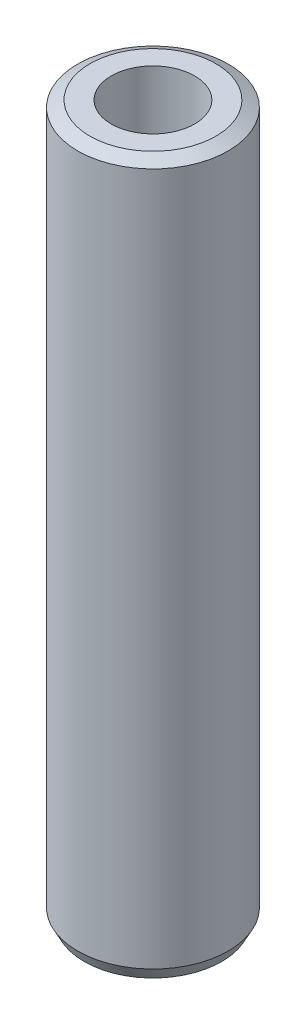
ISO-10303-21;
HEADER;
FILE_DESCRIPTION(('STEP AP214'),'2;1');
FILE_NAME('part.step','',(''),(''),'','','');
FILE_SCHEMA(('AUTOMOTIVE_DESIGN { 1 0 10303 214 1 1 1 1 }'));
ENDSEC;
DATA;
#1=APPLICATION_CONTEXT('core data for automotive mechanical design processes');
#2=APPLICATION_PROTOCOL_DEFINITION('international standard','automotive_design',2000,#1);
#3=PRODUCT_CONTEXT('',#1,'mechanical');
#4=PRODUCT('Part','Part','',(#3));
#5=PRODUCT_RELATED_PRODUCT_CATEGORY('part','',(#4));
#6=PRODUCT_DEFINITION_FORMATION('','',#4);
#7=PRODUCT_DEFINITION_CONTEXT('part definition',#1,'design');
#8=PRODUCT_DEFINITION('design','',#6,#7);
#9=PRODUCT_DEFINITION_SHAPE('','',#8);
#10=(LENGTH_UNIT() NAMED_UNIT(*) SI_UNIT(.MILLI.,.METRE.));
#11=(NAMED_UNIT(*) PLANE_ANGLE_UNIT() SI_UNIT($,.RADIAN.));
#12=(NAMED_UNIT(*) SI_UNIT($,.STERADIAN.) SOLID_ANGLE_UNIT());
#13=UNCERTAINTY_MEASURE_WITH_UNIT(LENGTH_MEASURE(1.E-05),#10,'distance_accuracy_value','');
#14=(GEOMETRIC_REPRESENTATION_CONTEXT(3) GLOBAL_UNCERTAINTY_ASSIGNED_CONTEXT((#13)) GLOBAL_UNIT_ASSIGNED_CONTEXT((#10,
#11,#12)) REPRESENTATION_CONTEXT('',''));
#15=CARTESIAN_POINT('',(0.,0.,0.));
#16=DIRECTION('',(0.,0.,1.));
#17=DIRECTION('',(1.,0.,0.));
#18=AXIS2_PLACEMENT_3D('',#15,#16,#17);
#19=CARTESIAN_POINT('',(0.,543.585864411854,0.));
#20=DIRECTION('',(0.,-1.,0.));
#21=DIRECTION('',(0.,0.,-1.));
#22=AXIS2_PLACEMENT_3D('',#19,#20,#21);
#23=CYLINDRICAL_SURFACE('',#22,57.5);
#24=CARTESIAN_POINT('',(0.,538.599060666265,0.));
#25=DIRECTION('',(0.,1.,0.));
#26=DIRECTION('',(0.,0.,1.));
#27=AXIS2_PLACEMENT_3D('',#24,#25,#26);
#28=CIRCLE('',#27,57.5);
#29=CARTESIAN_POINT('',(0.,538.599060666265,57.5));
#30=VERTEX_POINT('',#29);
#31=EDGE_CURVE('E50',#30,#30,#28,.F.);
#32=ORIENTED_EDGE('',*,*,#31,.T.);
#33=EDGE_LOOP('',(#32));
#34=FACE_BOUND('',#33,.T.);
#35=CARTESIAN_POINT('',(0.,9.46466921031897,0.));
#36=DIRECTION('',(0.,1.,0.));
#37=DIRECTION('',(0.,0.,1.));
#38=AXIS2_PLACEMENT_3D('',#35,#36,#37);
#39=CIRCLE('',#38,57.5);
#40=CARTESIAN_POINT('',(0.,9.46466921031897,57.5));
#41=VERTEX_POINT('',#40);
#42=EDGE_CURVE('E51',#41,#41,#39,.T.);
#43=ORIENTED_EDGE('',*,*,#42,.T.);
#44=EDGE_LOOP('',(#43));
#45=FACE_BOUND('',#44,.T.);
#46=ADVANCED_FACE('F39',(#34,#45),#23,.T.);
#47=CARTESIAN_POINT('',(0.,543.585864411854,0.));
#48=DIRECTION('',(0.,1.,0.));
#49=DIRECTION('',(0.,0.,1.));
#50=AXIS2_PLACEMENT_3D('',#47,#48,#49);
#51=PLANE('',#50);
#52=CARTESIAN_POINT('',(0.,543.585864411854,0.));
#53=DIRECTION('',(0.,1.,0.));
#54=DIRECTION('',(0.,0.,1.));
#55=AXIS2_PLACEMENT_3D('',#52,#53,#54);
#56=CIRCLE('',#55,48.0353307896811);
#57=CARTESIAN_POINT('',(0.,543.585864411854,48.0353307896811));
#58=VERTEX_POINT('',#57);
#59=EDGE_CURVE('E54',#58,#58,#56,.T.);
#60=ORIENTED_EDGE('',*,*,#59,.T.);
#61=EDGE_LOOP('',(#60));
#62=FACE_BOUND('',#61,.T.);
#63=CARTESIAN_POINT('',(0.,543.585864411854,0.));
#64=DIRECTION('',(0.,1.,0.));
#65=DIRECTION('',(0.,0.,1.));
#66=AXIS2_PLACEMENT_3D('',#63,#64,#65);
#67=CIRCLE('',#66,31.8417238432678);
#68=CARTESIAN_POINT('',(0.,543.585864411854,31.8417238432678));
#69=VERTEX_POINT('',#68);
#70=EDGE_CURVE('E58',#69,#69,#67,.T.);
#71=ORIENTED_EDGE('',*,*,#70,.F.);
#72=EDGE_LOOP('',(#71));
#73=FACE_BOUND('',#72,.T.);
#74=ADVANCED_FACE('F69',(#62,#73),#51,.T.);
#75=CARTESIAN_POINT('',(0.,0.,0.));
#76=DIRECTION('',(0.,1.,0.));
#77=DIRECTION('',(0.,0.,1.));
#78=AXIS2_PLACEMENT_3D('',#75,#76,#77);
#79=PLANE('',#78);
#80=CARTESIAN_POINT('',(0.,0.,0.));
#81=DIRECTION('',(0.,1.,0.));
#82=DIRECTION('',(0.,0.,1.));
#83=AXIS2_PLACEMENT_3D('',#80,#81,#82);
#84=CIRCLE('',#83,52.5131962544113);
#85=CARTESIAN_POINT('',(0.,0.,52.5131962544113));
#86=VERTEX_POINT('',#85);
#87=EDGE_CURVE('E10',#86,#86,#84,.F.);
#88=ORIENTED_EDGE('',*,*,#87,.T.);
#89=EDGE_LOOP('',(#88));
#90=FACE_BOUND('',#89,.T.);
#91=CARTESIAN_POINT('',(0.,0.,0.));
#92=DIRECTION('',(0.,1.,0.));
#93=DIRECTION('',(0.,0.,1.));
#94=AXIS2_PLACEMENT_3D('',#91,#92,#93);
#95=CIRCLE('',#94,31.8417238432678);
#96=CARTESIAN_POINT('',(0.,0.,31.8417238432678));
#97=VERTEX_POINT('',#96);
#98=EDGE_CURVE('E63',#97,#97,#95,.T.);
#99=ORIENTED_EDGE('',*,*,#98,.T.);
#100=EDGE_LOOP('',(#99));
#101=FACE_BOUND('',#100,.T.);
#102=ADVANCED_FACE('F75',(#90,#101),#79,.F.);
#103=CARTESIAN_POINT('',(0.,543.585864411854,0.));
#104=DIRECTION('',(0.,-1.,0.));
#105=DIRECTION('',(0.,0.,-1.));
#106=AXIS2_PLACEMENT_3D('',#103,#104,#105);
#107=CYLINDRICAL_SURFACE('',#106,31.8417238432678);
#108=ORIENTED_EDGE('',*,*,#70,.T.);
#109=EDGE_LOOP('',(#108));
#110=FACE_BOUND('',#109,.T.);
#111=ORIENTED_EDGE('',*,*,#98,.F.);
#112=EDGE_LOOP('',(#111));
#113=FACE_BOUND('',#112,.T.);
#114=ADVANCED_FACE('F70',(#110,#113),#107,.F.);
#115=CARTESIAN_POINT('',(0.,543.585864411854,0.));
#116=DIRECTION('',(0.,-1.,0.));
#117=DIRECTION('',(0.,0.,-1.));
#118=AXIS2_PLACEMENT_3D('',#115,#116,#117);
#119=CONICAL_SURFACE('',#118,48.0353307896811,1.08587181305399);
#120=ORIENTED_EDGE('',*,*,#31,.F.);
#121=EDGE_LOOP('',(#120));
#122=FACE_BOUND('',#121,.T.);
#123=ORIENTED_EDGE('',*,*,#59,.F.);
#124=EDGE_LOOP('',(#123));
#125=FACE_BOUND('',#124,.T.);
#126=ADVANCED_FACE('F81',(#122,#125),#119,.T.);
#127=CARTESIAN_POINT('',(0.,9.46466921031897,0.));
#128=DIRECTION('',(0.,1.,0.));
#129=DIRECTION('',(0.,0.,1.));
#130=AXIS2_PLACEMENT_3D('',#127,#128,#129);
#131=CONICAL_SURFACE('',#130,57.5,0.484924513740904);
#132=CARTESIAN_POINT('',(0.,0.,52.5131962544113));
#133=CARTESIAN_POINT('',(0.,0.0985903042741541,52.5651421267612));
#134=CARTESIAN_POINT('',(0.,0.19718060854831,52.6170879991111));
#135=CARTESIAN_POINT('',(0.,0.394361217096622,52.7209797438108));
#136=CARTESIAN_POINT('',(0.,0.492951521370778,52.7729256161607));
#137=CARTESIAN_POINT('',(0.,0.69013212991909,52.8768173608605));
#138=CARTESIAN_POINT('',(0.,0.788722434193245,52.9287632332104));
#139=CARTESIAN_POINT('',(0.,0.985903042741557,53.0326549779101));
#140=CARTESIAN_POINT('',(0.,1.08449334701571,53.08460085026));
#141=CARTESIAN_POINT('',(0.,1.28167395556402,53.1884925949598));
#142=CARTESIAN_POINT('',(0.,1.38026425983818,53.2404384673097));
#143=CARTESIAN_POINT('',(0.,1.57744486838649,53.3443302120094));
#144=CARTESIAN_POINT('',(0.,1.67603517266065,53.3962760843593));
#145=CARTESIAN_POINT('',(0.,1.87321578120896,53.5001678290591));
#146=CARTESIAN_POINT('',(0.,1.97180608548312,53.5521137014089));
#147=CARTESIAN_POINT('',(0.,2.16898669403143,53.6560054461087));
#148=CARTESIAN_POINT('',(0.,2.26757699830558,53.7079513184586));
#149=CARTESIAN_POINT('',(0.,2.4647576068539,53.8118430631584));
#150=CARTESIAN_POINT('',(0.,2.56334791112805,53.8637889355082));
#151=CARTESIAN_POINT('',(0.,2.76052851967636,53.967680680208));
#152=CARTESIAN_POINT('',(0.,2.85911882395052,54.0196265525579));
#153=CARTESIAN_POINT('',(0.,3.05629943249883,54.1235182972577));
#154=CARTESIAN_POINT('',(0.,3.15488973677299,54.1754641696075));
#155=CARTESIAN_POINT('',(0.,3.3520703453213,54.2793559143073));
#156=CARTESIAN_POINT('',(0.,3.45066064959546,54.3313017866572));
#157=CARTESIAN_POINT('',(0.,3.64784125814377,54.435193531357));
#158=CARTESIAN_POINT('',(0.,3.74643156241792,54.4871394037068));
#159=CARTESIAN_POINT('',(0.,3.94361217096624,54.5910311484066));
#160=CARTESIAN_POINT('',(0.,4.04220247524039,54.6429770207565));
#161=CARTESIAN_POINT('',(0.,4.2393830837887,54.7468687654562));
#162=CARTESIAN_POINT('',(0.,4.33797338806286,54.7988146378061));
#163=CARTESIAN_POINT('',(0.,4.53515399661117,54.9027063825059));
#164=CARTESIAN_POINT('',(0.,4.63374430088533,54.9546522548558));
#165=CARTESIAN_POINT('',(0.,4.83092490943364,55.0585439995555));
#166=CARTESIAN_POINT('',(0.,4.92951521370779,55.1104898719054));
#167=CARTESIAN_POINT('',(0.,5.12669582225611,55.2143816166052));
#168=CARTESIAN_POINT('',(0.,5.22528612653026,55.2663274889551));
#169=CARTESIAN_POINT('',(0.,5.42246673507857,55.3702192336548));
#170=CARTESIAN_POINT('',(0.,5.52105703935273,55.4221651060047));
#171=CARTESIAN_POINT('',(0.,5.71823764790104,55.5260568507045));
#172=CARTESIAN_POINT('',(0.,5.8168279521752,55.5780027230544));
#173=CARTESIAN_POINT('',(0.,6.01400856072351,55.6818944677541));
#174=CARTESIAN_POINT('',(0.,6.11259886499766,55.733840340104));
#175=CARTESIAN_POINT('',(0.,6.30977947354598,55.8377320848038));
#176=CARTESIAN_POINT('',(0.,6.40836977782013,55.8896779571537));
#177=CARTESIAN_POINT('',(0.,6.60555038636844,55.9935697018534));
#178=CARTESIAN_POINT('',(0.,6.7041406906426,56.0455155742033));
#179=CARTESIAN_POINT('',(0.,6.90132129919091,56.1494073189031));
#180=CARTESIAN_POINT('',(0.,6.99991160346507,56.2013531912529));
#181=CARTESIAN_POINT('',(0.,7.19709221201338,56.3052449359527));
#182=CARTESIAN_POINT('',(0.,7.29568251628754,56.3571908083026));
#183=CARTESIAN_POINT('',(0.,7.49286312483585,56.4610825530024));
#184=CARTESIAN_POINT('',(0.,7.59145342911,56.5130284253522));
#185=CARTESIAN_POINT('',(0.,7.78863403765831,56.616920170052));
#186=CARTESIAN_POINT('',(0.,7.88722434193247,56.6688660424019));
#187=CARTESIAN_POINT('',(0.,8.08440495048078,56.7727577871017));
#188=CARTESIAN_POINT('',(0.,8.18299525475494,56.8247036594515));
#189=CARTESIAN_POINT('',(0.,8.38017586330325,56.9285954041513));
#190=CARTESIAN_POINT('',(0.,8.47876616757741,56.9805412765012));
#191=CARTESIAN_POINT('',(0.,8.67594677612572,57.084433021201));
#192=CARTESIAN_POINT('',(0.,8.77453708039988,57.1363788935508));
#193=CARTESIAN_POINT('',(0.,8.97171768894819,57.2402706382506));
#194=CARTESIAN_POINT('',(0.,9.07030799322234,57.2922165106005));
#195=CARTESIAN_POINT('',(0.,9.26748860177065,57.3961082553002));
#196=CARTESIAN_POINT('',(0.,9.36607890604481,57.4480541276501));
#197=CARTESIAN_POINT('',(0.,9.46466921031897,57.5));
#198=B_SPLINE_CURVE_WITH_KNOTS('',3,(#132,#133,#134,#135,#136,#137,#138,#139,#140,#141,#142,
#143,#144,#145,#146,#147,#148,#149,#150,#151,#152,#153,#154,#155,#156,#157,#158,#159,#160,#161,
#162,#163,#164,#165,#166,#167,#168,#169,#170,#171,#172,#173,#174,#175,#176,#177,#178,#179,#180,
#181,#182,#183,#184,#185,#186,#187,#188,#189,#190,#191,#192,#193,#194,#195,#196,#197),
.UNSPECIFIED.,.F.,.F.,(4,2,2,2,2,2,2,2,2,2,2,2,2,2,2,2,2,2,2,2,2,2,2,2,2,2,2,2,2,2,2,2,4),(0.,
0.334313917986595,0.668627835973191,1.00294175395979,1.33725567194638,1.67156958993298,
2.00588350791957,2.34019742590617,2.67451134389276,3.00882526187936,3.34313917986595,
3.67745309785255,4.01176701583914,4.34608093382574,4.68039485181234,5.01470876979893,
5.34902268778553,5.68333660577212,6.01765052375872,6.35196444174531,6.68627835973191,
7.02059227771851,7.35490619570511,7.6892201136917,8.0235340316783,8.35784794966489,
8.69216186765149,9.02647578563808,9.36078970362468,9.69510362161127,10.0294175395979,
10.3637314575845,10.6980453755711),.UNSPECIFIED.);
#199=EDGE_CURVE('BSEAM45',#86,#41,#198,.T.);
#200=ORIENTED_EDGE('',*,*,#87,.F.);
#201=ORIENTED_EDGE('',*,*,#42,.F.);
#202=ORIENTED_EDGE('',*,*,#199,.T.);
#203=ORIENTED_EDGE('',*,*,#199,.F.);
#204=EDGE_LOOP('',(#200,#202,#201,#203));
#205=FACE_BOUND('',#204,.T.);
#206=ADVANCED_FACE('F45',(#205),#131,.T.);
#207=CLOSED_SHELL('',(#46,#74,#102,#114,#126,#206));
#208=MANIFOLD_SOLID_BREP('B2',#207);
#209=ADVANCED_BREP_SHAPE_REPRESENTATION('',(#18,#208),#14);
#210=SHAPE_DEFINITION_REPRESENTATION(#9,#209);
ENDSEC;
END-ISO-10303-21;
